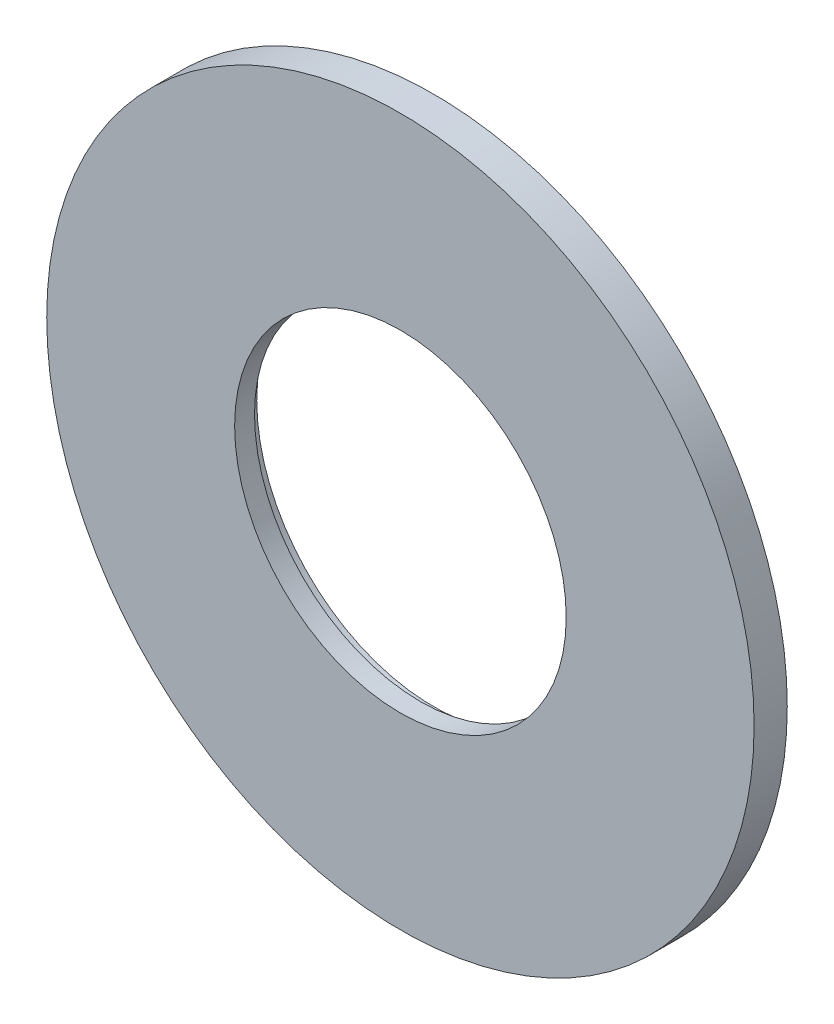
ISO-10303-21;
HEADER;
FILE_DESCRIPTION(('STEP AP214'),'2;1');
FILE_NAME('part.step','',(''),(''),'','','');
FILE_SCHEMA(('AUTOMOTIVE_DESIGN { 1 0 10303 214 1 1 1 1 }'));
ENDSEC;
DATA;
#1=APPLICATION_CONTEXT('core data for automotive mechanical design processes');
#2=APPLICATION_PROTOCOL_DEFINITION('international standard','automotive_design',2000,#1);
#3=PRODUCT_CONTEXT('',#1,'mechanical');
#4=PRODUCT('Part','Part','',(#3));
#5=PRODUCT_RELATED_PRODUCT_CATEGORY('part','',(#4));
#6=PRODUCT_DEFINITION_FORMATION('','',#4);
#7=PRODUCT_DEFINITION_CONTEXT('part definition',#1,'design');
#8=PRODUCT_DEFINITION('design','',#6,#7);
#9=PRODUCT_DEFINITION_SHAPE('','',#8);
#10=(LENGTH_UNIT() NAMED_UNIT(*) SI_UNIT(.MILLI.,.METRE.));
#11=(NAMED_UNIT(*) PLANE_ANGLE_UNIT() SI_UNIT($,.RADIAN.));
#12=(NAMED_UNIT(*) SI_UNIT($,.STERADIAN.) SOLID_ANGLE_UNIT());
#13=UNCERTAINTY_MEASURE_WITH_UNIT(LENGTH_MEASURE(1.E-05),#10,'distance_accuracy_value','');
#14=(GEOMETRIC_REPRESENTATION_CONTEXT(3) GLOBAL_UNCERTAINTY_ASSIGNED_CONTEXT((#13)) GLOBAL_UNIT_ASSIGNED_CONTEXT((#10,
#11,#12)) REPRESENTATION_CONTEXT('',''));
#15=CARTESIAN_POINT('',(0.,0.,0.));
#16=DIRECTION('',(0.,0.,1.));
#17=DIRECTION('',(1.,0.,0.));
#18=AXIS2_PLACEMENT_3D('',#15,#16,#17);
#19=CARTESIAN_POINT('',(0.,0.,0.));
#20=DIRECTION('',(0.,0.,1.));
#21=DIRECTION('',(1.,0.,0.));
#22=AXIS2_PLACEMENT_3D('',#19,#20,#21);
#23=PLANE('',#22);
#24=CARTESIAN_POINT('',(-12.5,1.30930550206618E-13,0.));
#25=DIRECTION('',(0.,0.,1.));
#26=DIRECTION('',(1.,0.,0.));
#27=AXIS2_PLACEMENT_3D('',#24,#25,#26);
#28=CIRCLE('',#27,1.45);
#29=CARTESIAN_POINT('',(-11.05,1.30930550206618E-13,0.));
#30=VERTEX_POINT('',#29);
#31=EDGE_CURVE('E10',#30,#30,#28,.F.);
#32=ORIENTED_EDGE('',*,*,#31,.F.);
#33=EDGE_LOOP('',(#32));
#34=FACE_BOUND('',#33,.T.);
#35=CARTESIAN_POINT('',(0.,-12.5,0.));
#36=DIRECTION('',(0.,0.,1.));
#37=DIRECTION('',(1.,0.,0.));
#38=AXIS2_PLACEMENT_3D('',#35,#36,#37);
#39=CIRCLE('',#38,1.45);
#40=CARTESIAN_POINT('',(1.45,-12.5,0.));
#41=VERTEX_POINT('',#40);
#42=EDGE_CURVE('E46',#41,#41,#39,.F.);
#43=ORIENTED_EDGE('',*,*,#42,.F.);
#44=EDGE_LOOP('',(#43));
#45=FACE_BOUND('',#44,.T.);
#46=CARTESIAN_POINT('',(12.5,0.,0.));
#47=DIRECTION('',(0.,0.,1.));
#48=DIRECTION('',(1.,0.,0.));
#49=AXIS2_PLACEMENT_3D('',#46,#47,#48);
#50=CIRCLE('',#49,1.45);
#51=CARTESIAN_POINT('',(13.95,0.,0.));
#52=VERTEX_POINT('',#51);
#53=EDGE_CURVE('E50',#52,#52,#50,.F.);
#54=ORIENTED_EDGE('',*,*,#53,.F.);
#55=EDGE_LOOP('',(#54));
#56=FACE_BOUND('',#55,.T.);
#57=CARTESIAN_POINT('',(0.,12.5,0.));
#58=DIRECTION('',(0.,0.,1.));
#59=DIRECTION('',(1.,0.,0.));
#60=AXIS2_PLACEMENT_3D('',#57,#58,#59);
#61=CIRCLE('',#60,1.45);
#62=CARTESIAN_POINT('',(1.45,12.5,0.));
#63=VERTEX_POINT('',#62);
#64=EDGE_CURVE('E54',#63,#63,#61,.F.);
#65=ORIENTED_EDGE('',*,*,#64,.F.);
#66=EDGE_LOOP('',(#65));
#67=FACE_BOUND('',#66,.T.);
#68=CARTESIAN_POINT('',(0.,0.,0.));
#69=DIRECTION('',(0.,0.,1.));
#70=DIRECTION('',(1.,0.,0.));
#71=AXIS2_PLACEMENT_3D('',#68,#69,#70);
#72=CIRCLE('',#71,16.);
#73=CARTESIAN_POINT('',(16.,0.,0.));
#74=VERTEX_POINT('',#73);
#75=EDGE_CURVE('E59',#74,#74,#72,.T.);
#76=ORIENTED_EDGE('',*,*,#75,.F.);
#77=EDGE_LOOP('',(#76));
#78=FACE_BOUND('',#77,.T.);
#79=CARTESIAN_POINT('',(0.,0.,0.));
#80=DIRECTION('',(0.,0.,1.));
#81=DIRECTION('',(1.,0.,0.));
#82=AXIS2_PLACEMENT_3D('',#79,#80,#81);
#83=CIRCLE('',#82,8.);
#84=CARTESIAN_POINT('',(8.,0.,0.));
#85=VERTEX_POINT('',#84);
#86=EDGE_CURVE('E62',#85,#85,#83,.T.);
#87=ORIENTED_EDGE('',*,*,#86,.T.);
#88=EDGE_LOOP('',(#87));
#89=FACE_BOUND('',#88,.T.);
#90=ADVANCED_FACE('F39',(#34,#45,#56,#67,#78,#89),#23,.F.);
#91=CARTESIAN_POINT('',(0.,0.,0.6));
#92=DIRECTION('',(0.,0.,-1.));
#93=DIRECTION('',(-1.,0.,0.));
#94=AXIS2_PLACEMENT_3D('',#91,#92,#93);
#95=CYLINDRICAL_SURFACE('',#94,16.);
#96=ORIENTED_EDGE('',*,*,#75,.T.);
#97=EDGE_LOOP('',(#96));
#98=FACE_BOUND('',#97,.T.);
#99=CARTESIAN_POINT('',(0.,0.,1.5));
#100=DIRECTION('',(0.,0.,1.));
#101=DIRECTION('',(1.,0.,0.));
#102=AXIS2_PLACEMENT_3D('',#99,#100,#101);
#103=CIRCLE('',#102,16.);
#104=CARTESIAN_POINT('',(16.,0.,1.5));
#105=VERTEX_POINT('',#104);
#106=EDGE_CURVE('E68',#105,#105,#103,.T.);
#107=ORIENTED_EDGE('',*,*,#106,.F.);
#108=EDGE_LOOP('',(#107));
#109=FACE_BOUND('',#108,.T.);
#110=ADVANCED_FACE('F41',(#98,#109),#95,.T.);
#111=CARTESIAN_POINT('',(0.,0.,0.6));
#112=DIRECTION('',(0.,0.,-1.));
#113=DIRECTION('',(-1.,0.,0.));
#114=AXIS2_PLACEMENT_3D('',#111,#112,#113);
#115=CYLINDRICAL_SURFACE('',#114,8.);
#116=CARTESIAN_POINT('',(0.,0.,0.6));
#117=DIRECTION('',(0.,0.,1.));
#118=DIRECTION('',(1.,0.,0.));
#119=AXIS2_PLACEMENT_3D('',#116,#117,#118);
#120=CIRCLE('',#119,8.);
#121=CARTESIAN_POINT('',(8.,0.,0.6));
#122=VERTEX_POINT('',#121);
#123=EDGE_CURVE('E65',#122,#122,#120,.T.);
#124=ORIENTED_EDGE('',*,*,#123,.T.);
#125=EDGE_LOOP('',(#124));
#126=FACE_BOUND('',#125,.T.);
#127=ORIENTED_EDGE('',*,*,#86,.F.);
#128=EDGE_LOOP('',(#127));
#129=FACE_BOUND('',#128,.T.);
#130=ADVANCED_FACE('F109',(#126,#129),#115,.F.);
#131=CARTESIAN_POINT('',(0.,0.,0.6));
#132=DIRECTION('',(0.,0.,1.));
#133=DIRECTION('',(1.,0.,0.));
#134=AXIS2_PLACEMENT_3D('',#131,#132,#133);
#135=PLANE('',#134);
#136=CARTESIAN_POINT('',(0.,0.,0.6));
#137=DIRECTION('',(0.,0.,1.));
#138=DIRECTION('',(1.,0.,0.));
#139=AXIS2_PLACEMENT_3D('',#136,#137,#138);
#140=CIRCLE('',#139,7.5);
#141=CARTESIAN_POINT('',(7.5,0.,0.6));
#142=VERTEX_POINT('',#141);
#143=EDGE_CURVE('E72',#142,#142,#140,.T.);
#144=ORIENTED_EDGE('',*,*,#143,.T.);
#145=EDGE_LOOP('',(#144));
#146=FACE_BOUND('',#145,.T.);
#147=ORIENTED_EDGE('',*,*,#123,.F.);
#148=EDGE_LOOP('',(#147));
#149=FACE_BOUND('',#148,.T.);
#150=ADVANCED_FACE('F115',(#146,#149),#135,.F.);
#151=CARTESIAN_POINT('',(0.,0.,1.5));
#152=DIRECTION('',(0.,0.,1.));
#153=DIRECTION('',(1.,0.,0.));
#154=AXIS2_PLACEMENT_3D('',#151,#152,#153);
#155=PLANE('',#154);
#156=ORIENTED_EDGE('',*,*,#106,.T.);
#157=EDGE_LOOP('',(#156));
#158=FACE_BOUND('',#157,.T.);
#159=CARTESIAN_POINT('',(0.,0.,1.5));
#160=DIRECTION('',(0.,0.,1.));
#161=DIRECTION('',(1.,0.,0.));
#162=AXIS2_PLACEMENT_3D('',#159,#160,#161);
#163=CIRCLE('',#162,7.5);
#164=CARTESIAN_POINT('',(7.5,0.,1.5));
#165=VERTEX_POINT('',#164);
#166=EDGE_CURVE('E71',#165,#165,#163,.T.);
#167=ORIENTED_EDGE('',*,*,#166,.F.);
#168=EDGE_LOOP('',(#167));
#169=FACE_BOUND('',#168,.T.);
#170=ADVANCED_FACE('F119',(#158,#169),#155,.T.);
#171=CARTESIAN_POINT('',(0.,0.,1.5));
#172=DIRECTION('',(0.,0.,-1.));
#173=DIRECTION('',(-1.,0.,0.));
#174=AXIS2_PLACEMENT_3D('',#171,#172,#173);
#175=CYLINDRICAL_SURFACE('',#174,7.5);
#176=ORIENTED_EDGE('',*,*,#166,.T.);
#177=EDGE_LOOP('',(#176));
#178=FACE_BOUND('',#177,.T.);
#179=ORIENTED_EDGE('',*,*,#143,.F.);
#180=EDGE_LOOP('',(#179));
#181=FACE_BOUND('',#180,.T.);
#182=ADVANCED_FACE('F123',(#178,#181),#175,.F.);
#183=CARTESIAN_POINT('',(0.,12.5,-1.));
#184=DIRECTION('',(0.,0.,1.));
#185=DIRECTION('',(1.,0.,0.));
#186=AXIS2_PLACEMENT_3D('',#183,#184,#185);
#187=CYLINDRICAL_SURFACE('',#186,1.45);
#188=CARTESIAN_POINT('',(0.,12.5,-1.));
#189=DIRECTION('',(0.,0.,-1.));
#190=DIRECTION('',(-1.,0.,0.));
#191=AXIS2_PLACEMENT_3D('',#188,#189,#190);
#192=CIRCLE('',#191,1.45);
#193=CARTESIAN_POINT('',(-1.45,12.5,-1.));
#194=VERTEX_POINT('',#193);
#195=EDGE_CURVE('E75',#194,#194,#192,.T.);
#196=ORIENTED_EDGE('',*,*,#195,.F.);
#197=EDGE_LOOP('',(#196));
#198=FACE_BOUND('',#197,.T.);
#199=ORIENTED_EDGE('',*,*,#64,.T.);
#200=EDGE_LOOP('',(#199));
#201=FACE_BOUND('',#200,.T.);
#202=ADVANCED_FACE('F127',(#198,#201),#187,.T.);
#203=CARTESIAN_POINT('',(0.,12.5,-1.));
#204=DIRECTION('',(0.,0.,-1.));
#205=DIRECTION('',(-1.,0.,0.));
#206=AXIS2_PLACEMENT_3D('',#203,#204,#205);
#207=PLANE('',#206);
#208=ORIENTED_EDGE('',*,*,#195,.T.);
#209=EDGE_LOOP('',(#208));
#210=FACE_BOUND('',#209,.T.);
#211=ADVANCED_FACE('F131',(#210),#207,.T.);
#212=CARTESIAN_POINT('',(12.5,0.,-1.));
#213=DIRECTION('',(0.,0.,1.));
#214=DIRECTION('',(1.,0.,0.));
#215=AXIS2_PLACEMENT_3D('',#212,#213,#214);
#216=CYLINDRICAL_SURFACE('',#215,1.45);
#217=CARTESIAN_POINT('',(12.5,0.,-1.));
#218=DIRECTION('',(0.,0.,-1.));
#219=DIRECTION('',(0.,1.,0.));
#220=AXIS2_PLACEMENT_3D('',#217,#218,#219);
#221=CIRCLE('',#220,1.45);
#222=CARTESIAN_POINT('',(12.5,1.44999999999996,-1.));
#223=VERTEX_POINT('',#222);
#224=EDGE_CURVE('E80',#223,#223,#221,.T.);
#225=ORIENTED_EDGE('',*,*,#224,.F.);
#226=EDGE_LOOP('',(#225));
#227=FACE_BOUND('',#226,.T.);
#228=ORIENTED_EDGE('',*,*,#53,.T.);
#229=EDGE_LOOP('',(#228));
#230=FACE_BOUND('',#229,.T.);
#231=ADVANCED_FACE('F135',(#227,#230),#216,.T.);
#232=CARTESIAN_POINT('',(12.5,0.,-1.));
#233=DIRECTION('',(0.,0.,-1.));
#234=DIRECTION('',(0.,1.,0.));
#235=AXIS2_PLACEMENT_3D('',#232,#233,#234);
#236=PLANE('',#235);
#237=ORIENTED_EDGE('',*,*,#224,.T.);
#238=EDGE_LOOP('',(#237));
#239=FACE_BOUND('',#238,.T.);
#240=ADVANCED_FACE('F139',(#239),#236,.T.);
#241=CARTESIAN_POINT('',(0.,-12.5,-1.));
#242=DIRECTION('',(0.,0.,1.));
#243=DIRECTION('',(1.,0.,0.));
#244=AXIS2_PLACEMENT_3D('',#241,#242,#243);
#245=CYLINDRICAL_SURFACE('',#244,1.45);
#246=CARTESIAN_POINT('',(0.,-12.5,-1.));
#247=DIRECTION('',(0.,0.,-1.));
#248=DIRECTION('',(1.,0.,0.));
#249=AXIS2_PLACEMENT_3D('',#246,#247,#248);
#250=CIRCLE('',#249,1.45);
#251=CARTESIAN_POINT('',(1.45,-12.5,-1.));
#252=VERTEX_POINT('',#251);
#253=EDGE_CURVE('E83',#252,#252,#250,.T.);
#254=ORIENTED_EDGE('',*,*,#253,.F.);
#255=EDGE_LOOP('',(#254));
#256=FACE_BOUND('',#255,.T.);
#257=ORIENTED_EDGE('',*,*,#42,.T.);
#258=EDGE_LOOP('',(#257));
#259=FACE_BOUND('',#258,.T.);
#260=ADVANCED_FACE('F101',(#256,#259),#245,.T.);
#261=CARTESIAN_POINT('',(0.,-12.5,-1.));
#262=DIRECTION('',(0.,0.,-1.));
#263=DIRECTION('',(1.,0.,0.));
#264=AXIS2_PLACEMENT_3D('',#261,#262,#263);
#265=PLANE('',#264);
#266=ORIENTED_EDGE('',*,*,#253,.T.);
#267=EDGE_LOOP('',(#266));
#268=FACE_BOUND('',#267,.T.);
#269=ADVANCED_FACE('F94',(#268),#265,.T.);
#270=CARTESIAN_POINT('',(-12.5,1.30930550206618E-13,-1.));
#271=DIRECTION('',(0.,0.,1.));
#272=DIRECTION('',(1.,0.,0.));
#273=AXIS2_PLACEMENT_3D('',#270,#271,#272);
#274=CYLINDRICAL_SURFACE('',#273,1.45);
#275=CARTESIAN_POINT('',(-12.5,1.30930550206618E-13,-1.));
#276=DIRECTION('',(0.,0.,-1.));
#277=DIRECTION('',(0.,-1.,0.));
#278=AXIS2_PLACEMENT_3D('',#275,#276,#277);
#279=CIRCLE('',#278,1.45);
#280=CARTESIAN_POINT('',(-12.5,-1.44999999999987,-1.));
#281=VERTEX_POINT('',#280);
#282=EDGE_CURVE('E86',#281,#281,#279,.T.);
#283=ORIENTED_EDGE('',*,*,#282,.F.);
#284=EDGE_LOOP('',(#283));
#285=FACE_BOUND('',#284,.T.);
#286=ORIENTED_EDGE('',*,*,#31,.T.);
#287=EDGE_LOOP('',(#286));
#288=FACE_BOUND('',#287,.T.);
#289=ADVANCED_FACE('F92',(#285,#288),#274,.T.);
#290=CARTESIAN_POINT('',(-12.5,1.30930550206618E-13,-1.));
#291=DIRECTION('',(0.,0.,-1.));
#292=DIRECTION('',(0.,-1.,0.));
#293=AXIS2_PLACEMENT_3D('',#290,#291,#292);
#294=PLANE('',#293);
#295=ORIENTED_EDGE('',*,*,#282,.T.);
#296=EDGE_LOOP('',(#295));
#297=FACE_BOUND('',#296,.T.);
#298=ADVANCED_FACE('F90',(#297),#294,.T.);
#299=CLOSED_SHELL('',(#90,#110,#130,#150,#170,#182,#202,#211,#231,#240,#260,#269,#289,#298));
#300=MANIFOLD_SOLID_BREP('B2',#299);
#301=ADVANCED_BREP_SHAPE_REPRESENTATION('',(#18,#300),#14);
#302=SHAPE_DEFINITION_REPRESENTATION(#9,#301);
ENDSEC;
END-ISO-10303-21;
